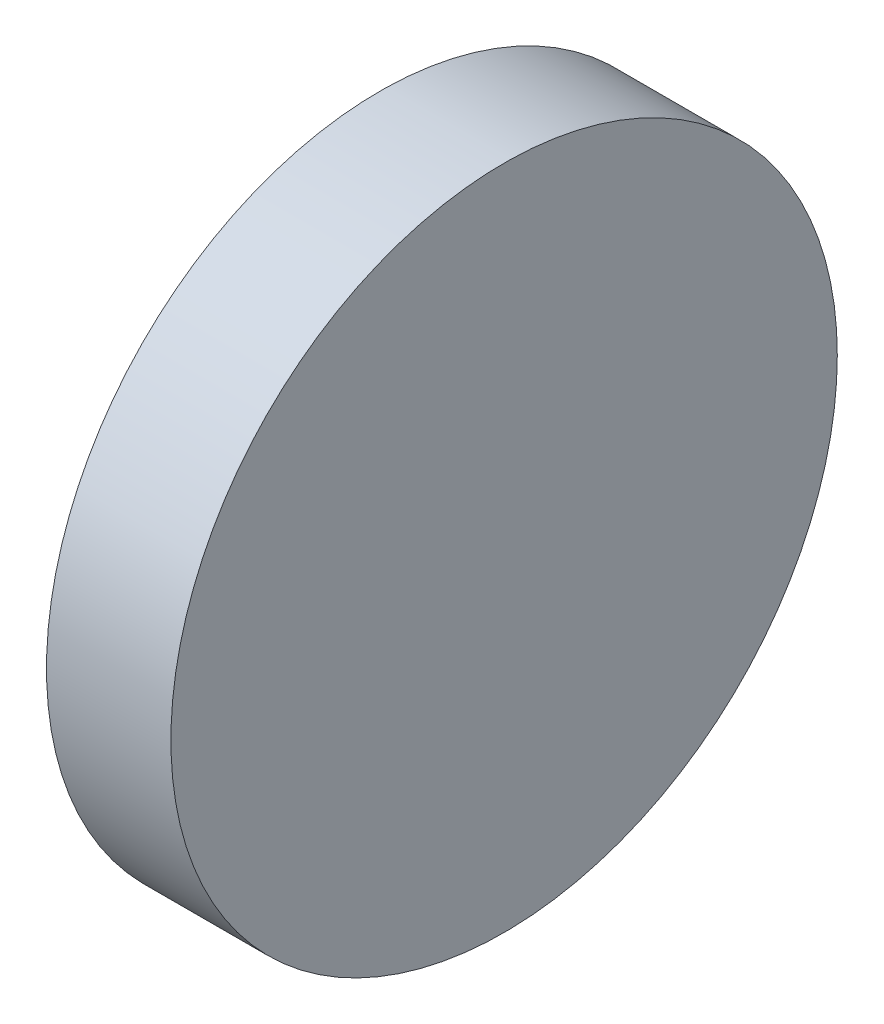
ISO-10303-21;
HEADER;
FILE_DESCRIPTION(('STEP AP214'),'2;1');
FILE_NAME('part.step','',(''),(''),'','','');
FILE_SCHEMA(('AUTOMOTIVE_DESIGN { 1 0 10303 214 1 1 1 1 }'));
ENDSEC;
DATA;
#1=APPLICATION_CONTEXT('core data for automotive mechanical design processes');
#2=APPLICATION_PROTOCOL_DEFINITION('international standard','automotive_design',2000,#1);
#3=PRODUCT_CONTEXT('',#1,'mechanical');
#4=PRODUCT('Part','Part','',(#3));
#5=PRODUCT_RELATED_PRODUCT_CATEGORY('part','',(#4));
#6=PRODUCT_DEFINITION_FORMATION('','',#4);
#7=PRODUCT_DEFINITION_CONTEXT('part definition',#1,'design');
#8=PRODUCT_DEFINITION('design','',#6,#7);
#9=PRODUCT_DEFINITION_SHAPE('','',#8);
#10=(LENGTH_UNIT() NAMED_UNIT(*) SI_UNIT(.MILLI.,.METRE.));
#11=(NAMED_UNIT(*) PLANE_ANGLE_UNIT() SI_UNIT($,.RADIAN.));
#12=(NAMED_UNIT(*) SI_UNIT($,.STERADIAN.) SOLID_ANGLE_UNIT());
#13=UNCERTAINTY_MEASURE_WITH_UNIT(LENGTH_MEASURE(1.E-05),#10,'distance_accuracy_value','');
#14=(GEOMETRIC_REPRESENTATION_CONTEXT(3) GLOBAL_UNCERTAINTY_ASSIGNED_CONTEXT((#13)) GLOBAL_UNIT_ASSIGNED_CONTEXT((#10,
#11,#12)) REPRESENTATION_CONTEXT('',''));
#15=CARTESIAN_POINT('',(0.,0.,0.));
#16=DIRECTION('',(0.,0.,1.));
#17=DIRECTION('',(1.,0.,0.));
#18=AXIS2_PLACEMENT_3D('',#15,#16,#17);
#19=CARTESIAN_POINT('',(7.,0.,0.));
#20=DIRECTION('',(-1.,0.,0.));
#21=DIRECTION('',(0.,0.,1.));
#22=AXIS2_PLACEMENT_3D('',#19,#20,#21);
#23=CYLINDRICAL_SURFACE('',#22,37.5);
#24=CARTESIAN_POINT('',(7.,0.,0.));
#25=DIRECTION('',(1.,0.,0.));
#26=DIRECTION('',(0.,0.,-1.));
#27=AXIS2_PLACEMENT_3D('',#24,#25,#26);
#28=CIRCLE('',#27,37.5);
#29=CARTESIAN_POINT('',(7.,0.,-37.5));
#30=VERTEX_POINT('',#29);
#31=EDGE_CURVE('E10',#30,#30,#28,.T.);
#32=ORIENTED_EDGE('',*,*,#31,.F.);
#33=EDGE_LOOP('',(#32));
#34=FACE_BOUND('',#33,.T.);
#35=CARTESIAN_POINT('',(-7.,0.,0.));
#36=DIRECTION('',(1.,0.,0.));
#37=DIRECTION('',(0.,0.,-1.));
#38=AXIS2_PLACEMENT_3D('',#35,#36,#37);
#39=CIRCLE('',#38,37.5);
#40=CARTESIAN_POINT('',(-7.,0.,-37.5));
#41=VERTEX_POINT('',#40);
#42=EDGE_CURVE('E34',#41,#41,#39,.T.);
#43=ORIENTED_EDGE('',*,*,#42,.T.);
#44=EDGE_LOOP('',(#43));
#45=FACE_BOUND('',#44,.T.);
#46=ADVANCED_FACE('F31',(#34,#45),#23,.T.);
#47=CARTESIAN_POINT('',(7.,0.,0.));
#48=DIRECTION('',(1.,0.,0.));
#49=DIRECTION('',(0.,0.,-1.));
#50=AXIS2_PLACEMENT_3D('',#47,#48,#49);
#51=PLANE('',#50);
#52=ORIENTED_EDGE('',*,*,#31,.T.);
#53=EDGE_LOOP('',(#52));
#54=FACE_BOUND('',#53,.T.);
#55=ADVANCED_FACE('F46',(#54),#51,.T.);
#56=CARTESIAN_POINT('',(-7.,0.,0.));
#57=DIRECTION('',(1.,0.,0.));
#58=DIRECTION('',(0.,0.,-1.));
#59=AXIS2_PLACEMENT_3D('',#56,#57,#58);
#60=PLANE('',#59);
#61=ORIENTED_EDGE('',*,*,#42,.F.);
#62=EDGE_LOOP('',(#61));
#63=FACE_BOUND('',#62,.T.);
#64=ADVANCED_FACE('F44',(#63),#60,.F.);
#65=CLOSED_SHELL('',(#46,#55,#64));
#66=MANIFOLD_SOLID_BREP('B2',#65);
#67=ADVANCED_BREP_SHAPE_REPRESENTATION('',(#18,#66),#14);
#68=SHAPE_DEFINITION_REPRESENTATION(#9,#67);
ENDSEC;
END-ISO-10303-21;
